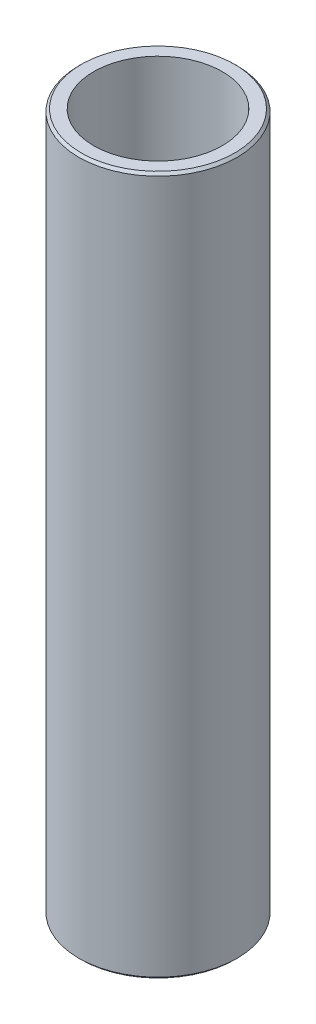
ISO-10303-21;
HEADER;
FILE_DESCRIPTION(('STEP AP214'),'2;1');
FILE_NAME('part.step','',(''),(''),'','','');
FILE_SCHEMA(('AUTOMOTIVE_DESIGN { 1 0 10303 214 1 1 1 1 }'));
ENDSEC;
DATA;
#1=APPLICATION_CONTEXT('core data for automotive mechanical design processes');
#2=APPLICATION_PROTOCOL_DEFINITION('international standard','automotive_design',2000,#1);
#3=PRODUCT_CONTEXT('',#1,'mechanical');
#4=PRODUCT('Part','Part','',(#3));
#5=PRODUCT_RELATED_PRODUCT_CATEGORY('part','',(#4));
#6=PRODUCT_DEFINITION_FORMATION('','',#4);
#7=PRODUCT_DEFINITION_CONTEXT('part definition',#1,'design');
#8=PRODUCT_DEFINITION('design','',#6,#7);
#9=PRODUCT_DEFINITION_SHAPE('','',#8);
#10=(LENGTH_UNIT() NAMED_UNIT(*) SI_UNIT(.MILLI.,.METRE.));
#11=(NAMED_UNIT(*) PLANE_ANGLE_UNIT() SI_UNIT($,.RADIAN.));
#12=(NAMED_UNIT(*) SI_UNIT($,.STERADIAN.) SOLID_ANGLE_UNIT());
#13=UNCERTAINTY_MEASURE_WITH_UNIT(LENGTH_MEASURE(1.E-05),#10,'distance_accuracy_value','');
#14=(GEOMETRIC_REPRESENTATION_CONTEXT(3) GLOBAL_UNCERTAINTY_ASSIGNED_CONTEXT((#13)) GLOBAL_UNIT_ASSIGNED_CONTEXT((#10,
#11,#12)) REPRESENTATION_CONTEXT('',''));
#15=CARTESIAN_POINT('',(0.,0.,0.));
#16=DIRECTION('',(0.,0.,1.));
#17=DIRECTION('',(1.,0.,0.));
#18=AXIS2_PLACEMENT_3D('',#15,#16,#17);
#19=CARTESIAN_POINT('',(0.,70.,0.));
#20=DIRECTION('',(0.,1.,0.));
#21=DIRECTION('',(0.,0.,1.));
#22=AXIS2_PLACEMENT_3D('',#19,#20,#21);
#23=PLANE('',#22);
#24=CARTESIAN_POINT('',(0.,70.,0.));
#25=DIRECTION('',(0.,1.,0.));
#26=DIRECTION('',(0.,0.,1.));
#27=AXIS2_PLACEMENT_3D('',#24,#25,#26);
#28=CIRCLE('',#27,7.69000000000001);
#29=CARTESIAN_POINT('',(0.,70.,7.69000000000001));
#30=VERTEX_POINT('',#29);
#31=EDGE_CURVE('E10',#30,#30,#28,.T.);
#32=ORIENTED_EDGE('',*,*,#31,.T.);
#33=EDGE_LOOP('',(#32));
#34=FACE_BOUND('',#33,.T.);
#35=CARTESIAN_POINT('',(0.,70.,0.));
#36=DIRECTION('',(0.,1.,0.));
#37=DIRECTION('',(0.,0.,1.));
#38=AXIS2_PLACEMENT_3D('',#35,#36,#37);
#39=CIRCLE('',#38,6.44);
#40=CARTESIAN_POINT('',(0.,70.,6.44));
#41=VERTEX_POINT('',#40);
#42=EDGE_CURVE('E51',#41,#41,#39,.T.);
#43=ORIENTED_EDGE('',*,*,#42,.F.);
#44=EDGE_LOOP('',(#43));
#45=FACE_BOUND('',#44,.T.);
#46=ADVANCED_FACE('F31',(#34,#45),#23,.T.);
#47=CARTESIAN_POINT('',(0.,0.,0.));
#48=DIRECTION('',(0.,1.,0.));
#49=DIRECTION('',(0.,0.,1.));
#50=AXIS2_PLACEMENT_3D('',#47,#48,#49);
#51=PLANE('',#50);
#52=CARTESIAN_POINT('',(0.,0.,0.));
#53=DIRECTION('',(0.,1.,0.));
#54=DIRECTION('',(0.,0.,1.));
#55=AXIS2_PLACEMENT_3D('',#52,#53,#54);
#56=CIRCLE('',#55,7.69);
#57=CARTESIAN_POINT('',(0.,0.,7.69));
#58=VERTEX_POINT('',#57);
#59=EDGE_CURVE('E38',#58,#58,#56,.F.);
#60=ORIENTED_EDGE('',*,*,#59,.T.);
#61=EDGE_LOOP('',(#60));
#62=FACE_BOUND('',#61,.T.);
#63=CARTESIAN_POINT('',(0.,0.,0.));
#64=DIRECTION('',(0.,1.,0.));
#65=DIRECTION('',(0.,0.,1.));
#66=AXIS2_PLACEMENT_3D('',#63,#64,#65);
#67=CIRCLE('',#66,6.44);
#68=CARTESIAN_POINT('',(0.,0.,6.44));
#69=VERTEX_POINT('',#68);
#70=EDGE_CURVE('E52',#69,#69,#67,.T.);
#71=ORIENTED_EDGE('',*,*,#70,.T.);
#72=EDGE_LOOP('',(#71));
#73=FACE_BOUND('',#72,.T.);
#74=ADVANCED_FACE('F62',(#62,#73),#51,.F.);
#75=CARTESIAN_POINT('',(0.,70.,0.));
#76=DIRECTION('',(0.,-1.,0.));
#77=DIRECTION('',(0.,0.,-1.));
#78=AXIS2_PLACEMENT_3D('',#75,#76,#77);
#79=CYLINDRICAL_SURFACE('',#78,7.94);
#80=CARTESIAN_POINT('',(0.,0.25,0.));
#81=DIRECTION('',(0.,1.,0.));
#82=DIRECTION('',(0.,0.,1.));
#83=AXIS2_PLACEMENT_3D('',#80,#81,#82);
#84=CIRCLE('',#83,7.94);
#85=CARTESIAN_POINT('',(0.,0.25,7.94));
#86=VERTEX_POINT('',#85);
#87=EDGE_CURVE('E42',#86,#86,#84,.T.);
#88=ORIENTED_EDGE('',*,*,#87,.T.);
#89=EDGE_LOOP('',(#88));
#90=FACE_BOUND('',#89,.T.);
#91=CARTESIAN_POINT('',(0.,69.75,0.));
#92=DIRECTION('',(0.,1.,0.));
#93=DIRECTION('',(0.,0.,1.));
#94=AXIS2_PLACEMENT_3D('',#91,#92,#93);
#95=CIRCLE('',#94,7.94);
#96=CARTESIAN_POINT('',(0.,69.75,7.94));
#97=VERTEX_POINT('',#96);
#98=EDGE_CURVE('E46',#97,#97,#95,.F.);
#99=ORIENTED_EDGE('',*,*,#98,.T.);
#100=EDGE_LOOP('',(#99));
#101=FACE_BOUND('',#100,.T.);
#102=ADVANCED_FACE('F67',(#90,#101),#79,.T.);
#103=CARTESIAN_POINT('',(0.,70.,0.));
#104=DIRECTION('',(0.,-1.,0.));
#105=DIRECTION('',(0.,0.,-1.));
#106=AXIS2_PLACEMENT_3D('',#103,#104,#105);
#107=CYLINDRICAL_SURFACE('',#106,6.44);
#108=ORIENTED_EDGE('',*,*,#42,.T.);
#109=EDGE_LOOP('',(#108));
#110=FACE_BOUND('',#109,.T.);
#111=ORIENTED_EDGE('',*,*,#70,.F.);
#112=EDGE_LOOP('',(#111));
#113=FACE_BOUND('',#112,.T.);
#114=ADVANCED_FACE('F58',(#110,#113),#107,.F.);
#115=CARTESIAN_POINT('',(0.,0.25,0.));
#116=DIRECTION('',(0.,1.,0.));
#117=DIRECTION('',(0.,0.,1.));
#118=AXIS2_PLACEMENT_3D('',#115,#116,#117);
#119=CONICAL_SURFACE('',#118,7.94,0.785398163397445);
#120=ORIENTED_EDGE('',*,*,#59,.F.);
#121=EDGE_LOOP('',(#120));
#122=FACE_BOUND('',#121,.T.);
#123=ORIENTED_EDGE('',*,*,#87,.F.);
#124=EDGE_LOOP('',(#123));
#125=FACE_BOUND('',#124,.T.);
#126=ADVANCED_FACE('F73',(#122,#125),#119,.T.);
#127=CARTESIAN_POINT('',(0.,70.,0.));
#128=DIRECTION('',(0.,-1.,0.));
#129=DIRECTION('',(0.,0.,-1.));
#130=AXIS2_PLACEMENT_3D('',#127,#128,#129);
#131=CONICAL_SURFACE('',#130,7.69000000000001,0.785398163397431);
#132=ORIENTED_EDGE('',*,*,#98,.F.);
#133=EDGE_LOOP('',(#132));
#134=FACE_BOUND('',#133,.T.);
#135=ORIENTED_EDGE('',*,*,#31,.F.);
#136=EDGE_LOOP('',(#135));
#137=FACE_BOUND('',#136,.T.);
#138=ADVANCED_FACE('F33',(#134,#137),#131,.T.);
#139=CLOSED_SHELL('',(#46,#74,#102,#114,#126,#138));
#140=MANIFOLD_SOLID_BREP('B2',#139);
#141=ADVANCED_BREP_SHAPE_REPRESENTATION('',(#18,#140),#14);
#142=SHAPE_DEFINITION_REPRESENTATION(#9,#141);
ENDSEC;
END-ISO-10303-21;
